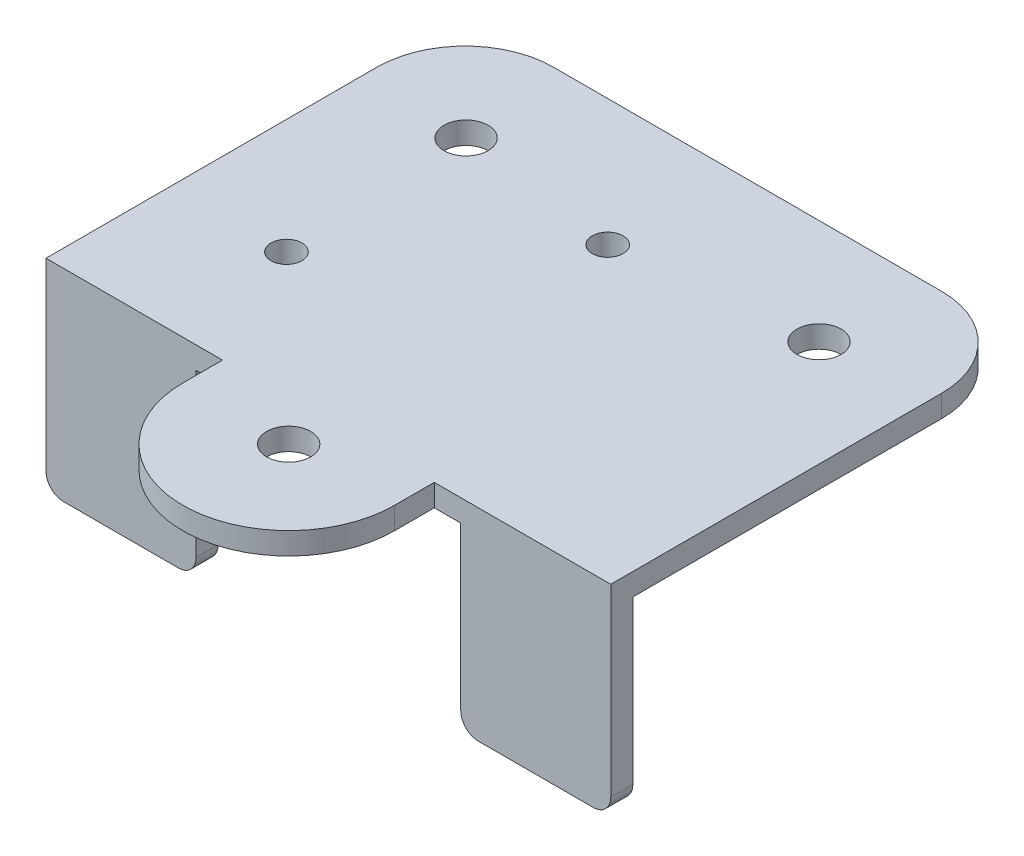
ISO-10303-21;
HEADER;
FILE_DESCRIPTION(('STEP AP214'),'2;1');
FILE_NAME('part.step','',(''),(''),'','','');
FILE_SCHEMA(('AUTOMOTIVE_DESIGN { 1 0 10303 214 1 1 1 1 }'));
ENDSEC;
DATA;
#1=APPLICATION_CONTEXT('core data for automotive mechanical design processes');
#2=APPLICATION_PROTOCOL_DEFINITION('international standard','automotive_design',2000,#1);
#3=PRODUCT_CONTEXT('',#1,'mechanical');
#4=PRODUCT('Part','Part','',(#3));
#5=PRODUCT_RELATED_PRODUCT_CATEGORY('part','',(#4));
#6=PRODUCT_DEFINITION_FORMATION('','',#4);
#7=PRODUCT_DEFINITION_CONTEXT('part definition',#1,'design');
#8=PRODUCT_DEFINITION('design','',#6,#7);
#9=PRODUCT_DEFINITION_SHAPE('','',#8);
#10=(LENGTH_UNIT() NAMED_UNIT(*) SI_UNIT(.MILLI.,.METRE.));
#11=(NAMED_UNIT(*) PLANE_ANGLE_UNIT() SI_UNIT($,.RADIAN.));
#12=(NAMED_UNIT(*) SI_UNIT($,.STERADIAN.) SOLID_ANGLE_UNIT());
#13=UNCERTAINTY_MEASURE_WITH_UNIT(LENGTH_MEASURE(1.E-05),#10,'distance_accuracy_value','');
#14=(GEOMETRIC_REPRESENTATION_CONTEXT(3) GLOBAL_UNCERTAINTY_ASSIGNED_CONTEXT((#13)) GLOBAL_UNIT_ASSIGNED_CONTEXT((#10,
#11,#12)) REPRESENTATION_CONTEXT('',''));
#15=CARTESIAN_POINT('',(0.,0.,0.));
#16=DIRECTION('',(0.,0.,1.));
#17=DIRECTION('',(1.,0.,0.));
#18=AXIS2_PLACEMENT_3D('',#15,#16,#17);
#19=CARTESIAN_POINT('',(0.,0.,0.));
#20=DIRECTION('',(0.,1.,0.));
#21=DIRECTION('',(0.,0.,1.));
#22=AXIS2_PLACEMENT_3D('',#19,#20,#21);
#23=PLANE('',#22);
#24=CARTESIAN_POINT('',(-20.,0.,-11.85));
#25=DIRECTION('',(0.,1.,0.));
#26=DIRECTION('',(0.,0.,1.));
#27=AXIS2_PLACEMENT_3D('',#24,#25,#26);
#28=CIRCLE('',#27,2.5);
#29=CARTESIAN_POINT('',(-20.,0.,-9.35));
#30=VERTEX_POINT('',#29);
#31=EDGE_CURVE('E192',#30,#30,#28,.T.);
#32=ORIENTED_EDGE('',*,*,#31,.T.);
#33=EDGE_LOOP('',(#32));
#34=FACE_BOUND('',#33,.T.);
#35=CARTESIAN_POINT('',(20.,0.,-11.85));
#36=DIRECTION('',(0.,1.,0.));
#37=DIRECTION('',(0.,0.,1.));
#38=AXIS2_PLACEMENT_3D('',#35,#36,#37);
#39=CIRCLE('',#38,2.5);
#40=CARTESIAN_POINT('',(20.,0.,-9.35));
#41=VERTEX_POINT('',#40);
#42=EDGE_CURVE('E490',#41,#41,#39,.T.);
#43=ORIENTED_EDGE('',*,*,#42,.T.);
#44=EDGE_LOOP('',(#43));
#45=FACE_BOUND('',#44,.T.);
#46=CARTESIAN_POINT('',(-1.5,0.,-9.4));
#47=DIRECTION('',(0.,1.,0.));
#48=DIRECTION('',(0.,0.,1.));
#49=AXIS2_PLACEMENT_3D('',#46,#47,#48);
#50=CIRCLE('',#49,1.75);
#51=CARTESIAN_POINT('',(-1.5,0.,-7.65));
#52=VERTEX_POINT('',#51);
#53=EDGE_CURVE('E329',#52,#52,#50,.T.);
#54=ORIENTED_EDGE('',*,*,#53,.T.);
#55=EDGE_LOOP('',(#54));
#56=FACE_BOUND('',#55,.T.);
#57=CARTESIAN_POINT('',(-19.,0.,9.5));
#58=DIRECTION('',(0.,1.,0.));
#59=DIRECTION('',(0.,0.,1.));
#60=AXIS2_PLACEMENT_3D('',#57,#58,#59);
#61=CIRCLE('',#60,1.75);
#62=CARTESIAN_POINT('',(-19.,0.,11.25));
#63=VERTEX_POINT('',#62);
#64=EDGE_CURVE('E325',#63,#63,#61,.T.);
#65=ORIENTED_EDGE('',*,*,#64,.T.);
#66=EDGE_LOOP('',(#65));
#67=FACE_BOUND('',#66,.T.);
#68=CARTESIAN_POINT('',(0.,0.,28.25));
#69=DIRECTION('',(0.,1.,0.));
#70=DIRECTION('',(0.,0.,1.));
#71=AXIS2_PLACEMENT_3D('',#68,#69,#70);
#72=CIRCLE('',#71,2.5);
#73=CARTESIAN_POINT('',(0.,0.,30.75));
#74=VERTEX_POINT('',#73);
#75=EDGE_CURVE('E299',#74,#74,#72,.F.);
#76=ORIENTED_EDGE('',*,*,#75,.F.);
#77=EDGE_LOOP('',(#76));
#78=FACE_BOUND('',#77,.T.);
#79=DIRECTION('',(0.,0.,-1.));
#80=VECTOR('',#79,1.);
#81=CARTESIAN_POINT('',(15.,0.,23.75));
#82=LINE('',#81,#80);
#83=CARTESIAN_POINT('',(15.,0.,23.75));
#84=VERTEX_POINT('',#83);
#85=CARTESIAN_POINT('',(15.,0.,21.25));
#86=VERTEX_POINT('',#85);
#87=EDGE_CURVE('E178',#84,#86,#82,.T.);
#88=ORIENTED_EDGE('',*,*,#87,.F.);
#89=DIRECTION('',(1.,0.,0.));
#90=VECTOR('',#89,1.);
#91=CARTESIAN_POINT('',(-32.,0.,23.75));
#92=LINE('',#91,#90);
#93=CARTESIAN_POINT('',(12.,0.,23.75));
#94=VERTEX_POINT('',#93);
#95=EDGE_CURVE('E187',#94,#84,#92,.T.);
#96=ORIENTED_EDGE('',*,*,#95,.F.);
#97=DIRECTION('',(0.,0.,1.));
#98=VECTOR('',#97,1.);
#99=CARTESIAN_POINT('',(12.,0.,23.75));
#100=LINE('',#99,#98);
#101=CARTESIAN_POINT('',(12.,0.,28.25));
#102=VERTEX_POINT('',#101);
#103=EDGE_CURVE('E297',#94,#102,#100,.T.);
#104=ORIENTED_EDGE('',*,*,#103,.T.);
#105=CARTESIAN_POINT('',(0.,0.,28.25));
#106=DIRECTION('',(0.,1.,0.));
#107=DIRECTION('',(0.,0.,1.));
#108=AXIS2_PLACEMENT_3D('',#105,#106,#107);
#109=CIRCLE('',#108,12.);
#110=CARTESIAN_POINT('',(-12.,0.,28.25));
#111=VERTEX_POINT('',#110);
#112=EDGE_CURVE('E300',#102,#111,#109,.F.);
#113=ORIENTED_EDGE('',*,*,#112,.T.);
#114=DIRECTION('',(0.,0.,-1.));
#115=VECTOR('',#114,1.);
#116=CARTESIAN_POINT('',(-12.,0.,28.25));
#117=LINE('',#116,#115);
#118=CARTESIAN_POINT('',(-12.,0.,23.75));
#119=VERTEX_POINT('',#118);
#120=EDGE_CURVE('E301',#111,#119,#117,.T.);
#121=ORIENTED_EDGE('',*,*,#120,.T.);
#122=CARTESIAN_POINT('',(-15.,0.,23.75));
#123=VERTEX_POINT('',#122);
#124=EDGE_CURVE('E197',#123,#119,#92,.T.);
#125=ORIENTED_EDGE('',*,*,#124,.F.);
#126=DIRECTION('',(0.,0.,1.));
#127=VECTOR('',#126,1.);
#128=CARTESIAN_POINT('',(-15.,0.,23.75));
#129=LINE('',#128,#127);
#130=CARTESIAN_POINT('',(-15.,0.,21.25));
#131=VERTEX_POINT('',#130);
#132=EDGE_CURVE('E283',#131,#123,#129,.T.);
#133=ORIENTED_EDGE('',*,*,#132,.F.);
#134=DIRECTION('',(1.,0.,0.));
#135=VECTOR('',#134,1.);
#136=CARTESIAN_POINT('',(-32.,0.,21.25));
#137=LINE('',#136,#135);
#138=CARTESIAN_POINT('',(-32.,0.,21.25));
#139=VERTEX_POINT('',#138);
#140=EDGE_CURVE('E182',#139,#131,#137,.T.);
#141=ORIENTED_EDGE('',*,*,#140,.F.);
#142=DIRECTION('',(0.,0.,1.));
#143=VECTOR('',#142,1.);
#144=CARTESIAN_POINT('',(-32.,0.,-23.75));
#145=LINE('',#144,#143);
#146=CARTESIAN_POINT('',(-32.,0.,-13.75));
#147=VERTEX_POINT('',#146);
#148=EDGE_CURVE('E198',#147,#139,#145,.T.);
#149=ORIENTED_EDGE('',*,*,#148,.F.);
#150=CARTESIAN_POINT('',(-22.,0.,-13.75));
#151=DIRECTION('',(0.,1.,0.));
#152=DIRECTION('',(0.,0.,1.));
#153=AXIS2_PLACEMENT_3D('',#150,#151,#152);
#154=CIRCLE('',#153,10.);
#155=CARTESIAN_POINT('',(-22.,0.,-23.75));
#156=VERTEX_POINT('',#155);
#157=EDGE_CURVE('E217',#147,#156,#154,.F.);
#158=ORIENTED_EDGE('',*,*,#157,.T.);
#159=DIRECTION('',(-1.,0.,0.));
#160=VECTOR('',#159,1.);
#161=CARTESIAN_POINT('',(-32.,0.,-23.75));
#162=LINE('',#161,#160);
#163=CARTESIAN_POINT('',(22.,0.,-23.75));
#164=VERTEX_POINT('',#163);
#165=EDGE_CURVE('E202',#164,#156,#162,.T.);
#166=ORIENTED_EDGE('',*,*,#165,.F.);
#167=CARTESIAN_POINT('',(22.,0.,-13.75));
#168=DIRECTION('',(0.,1.,0.));
#169=DIRECTION('',(0.,0.,1.));
#170=AXIS2_PLACEMENT_3D('',#167,#168,#169);
#171=CIRCLE('',#170,10.);
#172=CARTESIAN_POINT('',(32.,0.,-13.75));
#173=VERTEX_POINT('',#172);
#174=EDGE_CURVE('E219',#164,#173,#171,.F.);
#175=ORIENTED_EDGE('',*,*,#174,.T.);
#176=DIRECTION('',(0.,0.,-1.));
#177=VECTOR('',#176,1.);
#178=CARTESIAN_POINT('',(32.,0.,-23.75));
#179=LINE('',#178,#177);
#180=CARTESIAN_POINT('',(32.,0.,21.25));
#181=VERTEX_POINT('',#180);
#182=EDGE_CURVE('E335',#181,#173,#179,.T.);
#183=ORIENTED_EDGE('',*,*,#182,.F.);
#184=DIRECTION('',(1.,0.,0.));
#185=VECTOR('',#184,1.);
#186=CARTESIAN_POINT('',(32.,0.,21.25));
#187=LINE('',#186,#185);
#188=EDGE_CURVE('E191',#86,#181,#187,.T.);
#189=ORIENTED_EDGE('',*,*,#188,.F.);
#190=EDGE_LOOP('',(#88,#96,#104,#113,#121,#125,#133,#141,#149,#158,#166,#175,#183,#189));
#191=FACE_BOUND('',#190,.T.);
#192=ADVANCED_FACE('F39',(#34,#45,#56,#67,#78,#191),#23,.F.);
#193=CARTESIAN_POINT('',(-32.,2.5,23.75));
#194=DIRECTION('',(0.,0.,-1.));
#195=DIRECTION('',(-1.,0.,0.));
#196=AXIS2_PLACEMENT_3D('',#193,#194,#195);
#197=PLANE('',#196);
#198=DIRECTION('',(0.,1.,0.));
#199=VECTOR('',#198,1.);
#200=CARTESIAN_POINT('',(15.,-20.4,23.75));
#201=LINE('',#200,#199);
#202=CARTESIAN_POINT('',(15.,-18.4,23.75));
#203=VERTEX_POINT('',#202);
#204=EDGE_CURVE('E175',#203,#84,#201,.T.);
#205=ORIENTED_EDGE('',*,*,#204,.F.);
#206=CARTESIAN_POINT('',(17.,-18.4,23.75));
#207=DIRECTION('',(0.,0.,-1.));
#208=DIRECTION('',(-1.,0.,0.));
#209=AXIS2_PLACEMENT_3D('',#206,#207,#208);
#210=CIRCLE('',#209,2.);
#211=CARTESIAN_POINT('',(17.,-20.4,23.75));
#212=VERTEX_POINT('',#211);
#213=EDGE_CURVE('E47',#203,#212,#210,.F.);
#214=ORIENTED_EDGE('',*,*,#213,.T.);
#215=DIRECTION('',(-1.,0.,0.));
#216=VECTOR('',#215,1.);
#217=CARTESIAN_POINT('',(32.,-20.4,23.75));
#218=LINE('',#217,#216);
#219=CARTESIAN_POINT('',(30.,-20.4,23.75));
#220=VERTEX_POINT('',#219);
#221=EDGE_CURVE('E261',#220,#212,#218,.T.);
#222=ORIENTED_EDGE('',*,*,#221,.F.);
#223=CARTESIAN_POINT('',(30.,-18.4,23.75));
#224=DIRECTION('',(0.,0.,-1.));
#225=DIRECTION('',(-1.,0.,0.));
#226=AXIS2_PLACEMENT_3D('',#223,#224,#225);
#227=CIRCLE('',#226,2.);
#228=CARTESIAN_POINT('',(32.,-18.4,23.75));
#229=VERTEX_POINT('',#228);
#230=EDGE_CURVE('E54',#220,#229,#227,.F.);
#231=ORIENTED_EDGE('',*,*,#230,.T.);
#232=DIRECTION('',(0.,-1.,0.));
#233=VECTOR('',#232,1.);
#234=CARTESIAN_POINT('',(32.,2.5,23.75));
#235=LINE('',#234,#233);
#236=CARTESIAN_POINT('',(32.,2.5,23.75));
#237=VERTEX_POINT('',#236);
#238=EDGE_CURVE('E206',#237,#229,#235,.T.);
#239=ORIENTED_EDGE('',*,*,#238,.F.);
#240=DIRECTION('',(1.,0.,0.));
#241=VECTOR('',#240,1.);
#242=CARTESIAN_POINT('',(-32.,2.5,23.75));
#243=LINE('',#242,#241);
#244=CARTESIAN_POINT('',(12.,2.5,23.75));
#245=VERTEX_POINT('',#244);
#246=EDGE_CURVE('E345',#245,#237,#243,.T.);
#247=ORIENTED_EDGE('',*,*,#246,.F.);
#248=DIRECTION('',(0.,1.,0.));
#249=VECTOR('',#248,1.);
#250=CARTESIAN_POINT('',(12.,-29.1247317584214,23.75));
#251=LINE('',#250,#249);
#252=EDGE_CURVE('E196',#94,#245,#251,.T.);
#253=ORIENTED_EDGE('',*,*,#252,.F.);
#254=ORIENTED_EDGE('',*,*,#95,.T.);
#255=EDGE_LOOP('',(#205,#214,#222,#231,#239,#247,#253,#254));
#256=FACE_BOUND('',#255,.T.);
#257=ADVANCED_FACE('F194',(#256),#197,.F.);
#258=CARTESIAN_POINT('',(0.,2.5,0.));
#259=DIRECTION('',(0.,1.,0.));
#260=DIRECTION('',(0.,0.,1.));
#261=AXIS2_PLACEMENT_3D('',#258,#259,#260);
#262=PLANE('',#261);
#263=CARTESIAN_POINT('',(-20.,2.5,-11.85));
#264=DIRECTION('',(0.,1.,0.));
#265=DIRECTION('',(0.,0.,1.));
#266=AXIS2_PLACEMENT_3D('',#263,#264,#265);
#267=CIRCLE('',#266,2.5);
#268=CARTESIAN_POINT('',(-20.,2.5,-9.35));
#269=VERTEX_POINT('',#268);
#270=EDGE_CURVE('E483',#269,#269,#267,.T.);
#271=ORIENTED_EDGE('',*,*,#270,.F.);
#272=EDGE_LOOP('',(#271));
#273=FACE_BOUND('',#272,.T.);
#274=CARTESIAN_POINT('',(20.,2.5,-11.85));
#275=DIRECTION('',(0.,1.,0.));
#276=DIRECTION('',(0.,0.,1.));
#277=AXIS2_PLACEMENT_3D('',#274,#275,#276);
#278=CIRCLE('',#277,2.5);
#279=CARTESIAN_POINT('',(20.,2.5,-9.35));
#280=VERTEX_POINT('',#279);
#281=EDGE_CURVE('E487',#280,#280,#278,.T.);
#282=ORIENTED_EDGE('',*,*,#281,.F.);
#283=EDGE_LOOP('',(#282));
#284=FACE_BOUND('',#283,.T.);
#285=CARTESIAN_POINT('',(-1.5,2.5,-9.4));
#286=DIRECTION('',(0.,1.,0.));
#287=DIRECTION('',(0.,0.,1.));
#288=AXIS2_PLACEMENT_3D('',#285,#286,#287);
#289=CIRCLE('',#288,1.75);
#290=CARTESIAN_POINT('',(-1.5,2.5,-7.65));
#291=VERTEX_POINT('',#290);
#292=EDGE_CURVE('E332',#291,#291,#289,.T.);
#293=ORIENTED_EDGE('',*,*,#292,.F.);
#294=EDGE_LOOP('',(#293));
#295=FACE_BOUND('',#294,.T.);
#296=DIRECTION('',(0.,0.,-1.));
#297=VECTOR('',#296,1.);
#298=CARTESIAN_POINT('',(32.,2.5,-23.75));
#299=LINE('',#298,#297);
#300=CARTESIAN_POINT('',(32.,2.5,-13.75));
#301=VERTEX_POINT('',#300);
#302=EDGE_CURVE('E200',#237,#301,#299,.T.);
#303=ORIENTED_EDGE('',*,*,#302,.T.);
#304=CARTESIAN_POINT('',(22.,2.5,-13.75));
#305=DIRECTION('',(0.,1.,0.));
#306=DIRECTION('',(0.,0.,1.));
#307=AXIS2_PLACEMENT_3D('',#304,#305,#306);
#308=CIRCLE('',#307,10.);
#309=CARTESIAN_POINT('',(22.,2.5,-23.75));
#310=VERTEX_POINT('',#309);
#311=EDGE_CURVE('E226',#301,#310,#308,.T.);
#312=ORIENTED_EDGE('',*,*,#311,.T.);
#313=DIRECTION('',(-1.,0.,0.));
#314=VECTOR('',#313,1.);
#315=CARTESIAN_POINT('',(-32.,2.5,-23.75));
#316=LINE('',#315,#314);
#317=CARTESIAN_POINT('',(-22.,2.5,-23.75));
#318=VERTEX_POINT('',#317);
#319=EDGE_CURVE('E340',#310,#318,#316,.T.);
#320=ORIENTED_EDGE('',*,*,#319,.T.);
#321=CARTESIAN_POINT('',(-22.,2.5,-13.75));
#322=DIRECTION('',(0.,1.,0.));
#323=DIRECTION('',(0.,0.,1.));
#324=AXIS2_PLACEMENT_3D('',#321,#322,#323);
#325=CIRCLE('',#324,10.);
#326=CARTESIAN_POINT('',(-32.,2.5,-13.75));
#327=VERTEX_POINT('',#326);
#328=EDGE_CURVE('E224',#318,#327,#325,.T.);
#329=ORIENTED_EDGE('',*,*,#328,.T.);
#330=DIRECTION('',(0.,0.,1.));
#331=VECTOR('',#330,1.);
#332=CARTESIAN_POINT('',(-32.,2.5,-23.75));
#333=LINE('',#332,#331);
#334=CARTESIAN_POINT('',(-32.,2.5,23.75));
#335=VERTEX_POINT('',#334);
#336=EDGE_CURVE('E343',#327,#335,#333,.T.);
#337=ORIENTED_EDGE('',*,*,#336,.T.);
#338=CARTESIAN_POINT('',(-12.,2.5,23.75));
#339=VERTEX_POINT('',#338);
#340=EDGE_CURVE('E209',#335,#339,#243,.T.);
#341=ORIENTED_EDGE('',*,*,#340,.T.);
#342=DIRECTION('',(0.,0.,1.));
#343=VECTOR('',#342,1.);
#344=CARTESIAN_POINT('',(-12.,2.5,28.25));
#345=LINE('',#344,#343);
#346=CARTESIAN_POINT('',(-12.,2.5,28.25));
#347=VERTEX_POINT('',#346);
#348=EDGE_CURVE('E314',#339,#347,#345,.T.);
#349=ORIENTED_EDGE('',*,*,#348,.T.);
#350=CARTESIAN_POINT('',(0.,2.5,28.25));
#351=DIRECTION('',(0.,1.,0.));
#352=DIRECTION('',(0.,0.,1.));
#353=AXIS2_PLACEMENT_3D('',#350,#351,#352);
#354=CIRCLE('',#353,12.);
#355=CARTESIAN_POINT('',(12.,2.5,28.25));
#356=VERTEX_POINT('',#355);
#357=EDGE_CURVE('E308',#347,#356,#354,.T.);
#358=ORIENTED_EDGE('',*,*,#357,.T.);
#359=DIRECTION('',(0.,0.,-1.));
#360=VECTOR('',#359,1.);
#361=CARTESIAN_POINT('',(12.,2.5,23.75));
#362=LINE('',#361,#360);
#363=EDGE_CURVE('E311',#356,#245,#362,.T.);
#364=ORIENTED_EDGE('',*,*,#363,.T.);
#365=ORIENTED_EDGE('',*,*,#246,.T.);
#366=EDGE_LOOP('',(#303,#312,#320,#329,#337,#341,#349,#358,#364,#365));
#367=FACE_BOUND('',#366,.T.);
#368=CARTESIAN_POINT('',(-19.,2.5,9.5));
#369=DIRECTION('',(0.,1.,0.));
#370=DIRECTION('',(0.,0.,1.));
#371=AXIS2_PLACEMENT_3D('',#368,#369,#370);
#372=CIRCLE('',#371,1.75);
#373=CARTESIAN_POINT('',(-19.,2.5,11.25));
#374=VERTEX_POINT('',#373);
#375=EDGE_CURVE('E326',#374,#374,#372,.T.);
#376=ORIENTED_EDGE('',*,*,#375,.F.);
#377=EDGE_LOOP('',(#376));
#378=FACE_BOUND('',#377,.T.);
#379=CARTESIAN_POINT('',(0.,2.5,28.25));
#380=DIRECTION('',(0.,1.,0.));
#381=DIRECTION('',(0.,0.,1.));
#382=AXIS2_PLACEMENT_3D('',#379,#380,#381);
#383=CIRCLE('',#382,2.5);
#384=CARTESIAN_POINT('',(0.,2.5,30.75));
#385=VERTEX_POINT('',#384);
#386=EDGE_CURVE('E296',#385,#385,#383,.T.);
#387=ORIENTED_EDGE('',*,*,#386,.F.);
#388=EDGE_LOOP('',(#387));
#389=FACE_BOUND('',#388,.T.);
#390=ADVANCED_FACE('F361',(#273,#284,#295,#367,#378,#389),#262,.T.);
#391=CARTESIAN_POINT('',(32.,2.5,-23.75));
#392=DIRECTION('',(-1.,0.,0.));
#393=DIRECTION('',(0.,0.,1.));
#394=AXIS2_PLACEMENT_3D('',#391,#392,#393);
#395=PLANE('',#394);
#396=ORIENTED_EDGE('',*,*,#238,.T.);
#397=DIRECTION('',(0.,0.,1.));
#398=VECTOR('',#397,1.);
#399=CARTESIAN_POINT('',(32.,-18.4,-23.75));
#400=LINE('',#399,#398);
#401=CARTESIAN_POINT('',(32.,-18.4,21.25));
#402=VERTEX_POINT('',#401);
#403=EDGE_CURVE('E11',#229,#402,#400,.F.);
#404=ORIENTED_EDGE('',*,*,#403,.T.);
#405=DIRECTION('',(0.,1.,0.));
#406=VECTOR('',#405,1.);
#407=CARTESIAN_POINT('',(32.,-20.4,21.25));
#408=LINE('',#407,#406);
#409=EDGE_CURVE('E274',#402,#181,#408,.T.);
#410=ORIENTED_EDGE('',*,*,#409,.T.);
#411=ORIENTED_EDGE('',*,*,#182,.T.);
#412=DIRECTION('',(0.,-1.,0.));
#413=VECTOR('',#412,1.);
#414=CARTESIAN_POINT('',(32.,2.5,-13.75));
#415=LINE('',#414,#413);
#416=EDGE_CURVE('E222',#173,#301,#415,.F.);
#417=ORIENTED_EDGE('',*,*,#416,.T.);
#418=ORIENTED_EDGE('',*,*,#302,.F.);
#419=EDGE_LOOP('',(#396,#404,#410,#411,#417,#418));
#420=FACE_BOUND('',#419,.T.);
#421=ADVANCED_FACE('F435',(#420),#395,.F.);
#422=CARTESIAN_POINT('',(-32.,2.5,-23.75));
#423=DIRECTION('',(0.,0.,1.));
#424=DIRECTION('',(1.,0.,0.));
#425=AXIS2_PLACEMENT_3D('',#422,#423,#424);
#426=PLANE('',#425);
#427=ORIENTED_EDGE('',*,*,#319,.F.);
#428=DIRECTION('',(0.,-1.,0.));
#429=VECTOR('',#428,1.);
#430=CARTESIAN_POINT('',(22.,2.5,-23.75));
#431=LINE('',#430,#429);
#432=EDGE_CURVE('E214',#310,#164,#431,.T.);
#433=ORIENTED_EDGE('',*,*,#432,.T.);
#434=ORIENTED_EDGE('',*,*,#165,.T.);
#435=DIRECTION('',(0.,-1.,0.));
#436=VECTOR('',#435,1.);
#437=CARTESIAN_POINT('',(-22.,2.5,-23.75));
#438=LINE('',#437,#436);
#439=EDGE_CURVE('E212',#156,#318,#438,.F.);
#440=ORIENTED_EDGE('',*,*,#439,.T.);
#441=EDGE_LOOP('',(#427,#433,#434,#440));
#442=FACE_BOUND('',#441,.T.);
#443=ADVANCED_FACE('F353',(#442),#426,.F.);
#444=CARTESIAN_POINT('',(-32.,2.5,-23.75));
#445=DIRECTION('',(1.,0.,0.));
#446=DIRECTION('',(0.,0.,-1.));
#447=AXIS2_PLACEMENT_3D('',#444,#445,#446);
#448=PLANE('',#447);
#449=DIRECTION('',(0.,1.,0.));
#450=VECTOR('',#449,1.);
#451=CARTESIAN_POINT('',(-32.,-20.4,21.25));
#452=LINE('',#451,#450);
#453=CARTESIAN_POINT('',(-32.,-18.4,21.25));
#454=VERTEX_POINT('',#453);
#455=EDGE_CURVE('E294',#454,#139,#452,.T.);
#456=ORIENTED_EDGE('',*,*,#455,.F.);
#457=DIRECTION('',(0.,0.,-1.));
#458=VECTOR('',#457,1.);
#459=CARTESIAN_POINT('',(-32.,-18.4,23.75));
#460=LINE('',#459,#458);
#461=CARTESIAN_POINT('',(-32.,-18.4,23.75));
#462=VERTEX_POINT('',#461);
#463=EDGE_CURVE('E241',#454,#462,#460,.F.);
#464=ORIENTED_EDGE('',*,*,#463,.T.);
#465=DIRECTION('',(0.,-1.,0.));
#466=VECTOR('',#465,1.);
#467=CARTESIAN_POINT('',(-32.,2.5,23.75));
#468=LINE('',#467,#466);
#469=EDGE_CURVE('E208',#335,#462,#468,.T.);
#470=ORIENTED_EDGE('',*,*,#469,.F.);
#471=ORIENTED_EDGE('',*,*,#336,.F.);
#472=DIRECTION('',(0.,-1.,0.));
#473=VECTOR('',#472,1.);
#474=CARTESIAN_POINT('',(-32.,2.5,-13.75));
#475=LINE('',#474,#473);
#476=EDGE_CURVE('E228',#327,#147,#475,.T.);
#477=ORIENTED_EDGE('',*,*,#476,.T.);
#478=ORIENTED_EDGE('',*,*,#148,.T.);
#479=EDGE_LOOP('',(#456,#464,#470,#471,#477,#478));
#480=FACE_BOUND('',#479,.T.);
#481=ADVANCED_FACE('F366',(#480),#448,.F.);
#482=ORIENTED_EDGE('',*,*,#469,.T.);
#483=CARTESIAN_POINT('',(-30.,-18.4,23.75));
#484=DIRECTION('',(0.,0.,-1.));
#485=DIRECTION('',(-1.,0.,0.));
#486=AXIS2_PLACEMENT_3D('',#483,#484,#485);
#487=CIRCLE('',#486,2.);
#488=CARTESIAN_POINT('',(-30.,-20.4,23.75));
#489=VERTEX_POINT('',#488);
#490=EDGE_CURVE('E245',#462,#489,#487,.F.);
#491=ORIENTED_EDGE('',*,*,#490,.T.);
#492=DIRECTION('',(-1.,0.,0.));
#493=VECTOR('',#492,1.);
#494=CARTESIAN_POINT('',(-32.,-20.4,23.75));
#495=LINE('',#494,#493);
#496=CARTESIAN_POINT('',(-17.,-20.4,23.75));
#497=VERTEX_POINT('',#496);
#498=EDGE_CURVE('E282',#497,#489,#495,.T.);
#499=ORIENTED_EDGE('',*,*,#498,.F.);
#500=CARTESIAN_POINT('',(-17.,-18.4,23.75));
#501=DIRECTION('',(0.,0.,-1.));
#502=DIRECTION('',(-1.,0.,0.));
#503=AXIS2_PLACEMENT_3D('',#500,#501,#502);
#504=CIRCLE('',#503,2.);
#505=CARTESIAN_POINT('',(-15.,-18.4,23.75));
#506=VERTEX_POINT('',#505);
#507=EDGE_CURVE('E243',#497,#506,#504,.F.);
#508=ORIENTED_EDGE('',*,*,#507,.T.);
#509=DIRECTION('',(0.,1.,0.));
#510=VECTOR('',#509,1.);
#511=CARTESIAN_POINT('',(-15.,-20.4,23.75));
#512=LINE('',#511,#510);
#513=EDGE_CURVE('E286',#506,#123,#512,.T.);
#514=ORIENTED_EDGE('',*,*,#513,.T.);
#515=ORIENTED_EDGE('',*,*,#124,.T.);
#516=DIRECTION('',(0.,1.,0.));
#517=VECTOR('',#516,1.);
#518=CARTESIAN_POINT('',(-12.,-29.1247317584214,23.75));
#519=LINE('',#518,#517);
#520=EDGE_CURVE('E319',#119,#339,#519,.T.);
#521=ORIENTED_EDGE('',*,*,#520,.T.);
#522=ORIENTED_EDGE('',*,*,#340,.F.);
#523=EDGE_LOOP('',(#482,#491,#499,#508,#514,#515,#521,#522));
#524=FACE_BOUND('',#523,.T.);
#525=ADVANCED_FACE('F372',(#524),#197,.F.);
#526=CARTESIAN_POINT('',(-1.5,2.5,-9.4));
#527=DIRECTION('',(0.,-1.,0.));
#528=DIRECTION('',(0.,0.,-1.));
#529=AXIS2_PLACEMENT_3D('',#526,#527,#528);
#530=CYLINDRICAL_SURFACE('',#529,1.75);
#531=ORIENTED_EDGE('',*,*,#292,.T.);
#532=EDGE_LOOP('',(#531));
#533=FACE_BOUND('',#532,.T.);
#534=ORIENTED_EDGE('',*,*,#53,.F.);
#535=EDGE_LOOP('',(#534));
#536=FACE_BOUND('',#535,.T.);
#537=ADVANCED_FACE('F430',(#533,#536),#530,.F.);
#538=CARTESIAN_POINT('',(-19.,2.5,9.5));
#539=DIRECTION('',(0.,-1.,0.));
#540=DIRECTION('',(0.,0.,-1.));
#541=AXIS2_PLACEMENT_3D('',#538,#539,#540);
#542=CYLINDRICAL_SURFACE('',#541,1.75);
#543=ORIENTED_EDGE('',*,*,#375,.T.);
#544=EDGE_LOOP('',(#543));
#545=FACE_BOUND('',#544,.T.);
#546=ORIENTED_EDGE('',*,*,#64,.F.);
#547=EDGE_LOOP('',(#546));
#548=FACE_BOUND('',#547,.T.);
#549=ADVANCED_FACE('F441',(#545,#548),#542,.F.);
#550=CARTESIAN_POINT('',(22.,2.5,-13.75));
#551=DIRECTION('',(0.,-1.,0.));
#552=DIRECTION('',(0.,0.,-1.));
#553=AXIS2_PLACEMENT_3D('',#550,#551,#552);
#554=CYLINDRICAL_SURFACE('',#553,10.);
#555=ORIENTED_EDGE('',*,*,#311,.F.);
#556=ORIENTED_EDGE('',*,*,#416,.F.);
#557=ORIENTED_EDGE('',*,*,#174,.F.);
#558=ORIENTED_EDGE('',*,*,#432,.F.);
#559=EDGE_LOOP('',(#555,#556,#557,#558));
#560=FACE_BOUND('',#559,.T.);
#561=ADVANCED_FACE('F439',(#560),#554,.T.);
#562=CARTESIAN_POINT('',(-22.,2.5,-13.75));
#563=DIRECTION('',(0.,-1.,0.));
#564=DIRECTION('',(0.,0.,-1.));
#565=AXIS2_PLACEMENT_3D('',#562,#563,#564);
#566=CYLINDRICAL_SURFACE('',#565,10.);
#567=ORIENTED_EDGE('',*,*,#328,.F.);
#568=ORIENTED_EDGE('',*,*,#439,.F.);
#569=ORIENTED_EDGE('',*,*,#157,.F.);
#570=ORIENTED_EDGE('',*,*,#476,.F.);
#571=EDGE_LOOP('',(#567,#568,#569,#570));
#572=FACE_BOUND('',#571,.T.);
#573=ADVANCED_FACE('F357',(#572),#566,.T.);
#574=CARTESIAN_POINT('',(12.,-29.1247317584214,23.75));
#575=DIRECTION('',(1.,0.,0.));
#576=DIRECTION('',(0.,0.,-1.));
#577=AXIS2_PLACEMENT_3D('',#574,#575,#576);
#578=PLANE('',#577);
#579=ORIENTED_EDGE('',*,*,#103,.F.);
#580=ORIENTED_EDGE('',*,*,#252,.T.);
#581=ORIENTED_EDGE('',*,*,#363,.F.);
#582=DIRECTION('',(0.,1.,0.));
#583=VECTOR('',#582,1.);
#584=CARTESIAN_POINT('',(12.,-29.1247317584214,28.25));
#585=LINE('',#584,#583);
#586=EDGE_CURVE('E317',#102,#356,#585,.T.);
#587=ORIENTED_EDGE('',*,*,#586,.F.);
#588=EDGE_LOOP('',(#579,#580,#581,#587));
#589=FACE_BOUND('',#588,.T.);
#590=ADVANCED_FACE('F386',(#589),#578,.T.);
#591=CARTESIAN_POINT('',(-12.,-29.1247317584214,28.25));
#592=DIRECTION('',(-1.,0.,0.));
#593=DIRECTION('',(0.,0.,1.));
#594=AXIS2_PLACEMENT_3D('',#591,#592,#593);
#595=PLANE('',#594);
#596=ORIENTED_EDGE('',*,*,#120,.F.);
#597=DIRECTION('',(0.,1.,0.));
#598=VECTOR('',#597,1.);
#599=CARTESIAN_POINT('',(-12.,-29.1247317584214,28.25));
#600=LINE('',#599,#598);
#601=EDGE_CURVE('E304',#111,#347,#600,.T.);
#602=ORIENTED_EDGE('',*,*,#601,.T.);
#603=ORIENTED_EDGE('',*,*,#348,.F.);
#604=ORIENTED_EDGE('',*,*,#520,.F.);
#605=EDGE_LOOP('',(#596,#602,#603,#604));
#606=FACE_BOUND('',#605,.T.);
#607=ADVANCED_FACE('F377',(#606),#595,.T.);
#608=CARTESIAN_POINT('',(0.,-29.1247317584214,28.25));
#609=DIRECTION('',(0.,1.,0.));
#610=DIRECTION('',(0.,0.,1.));
#611=AXIS2_PLACEMENT_3D('',#608,#609,#610);
#612=CYLINDRICAL_SURFACE('',#611,12.);
#613=ORIENTED_EDGE('',*,*,#112,.F.);
#614=ORIENTED_EDGE('',*,*,#586,.T.);
#615=ORIENTED_EDGE('',*,*,#357,.F.);
#616=ORIENTED_EDGE('',*,*,#601,.F.);
#617=EDGE_LOOP('',(#613,#614,#615,#616));
#618=FACE_BOUND('',#617,.T.);
#619=ADVANCED_FACE('F382',(#618),#612,.T.);
#620=CARTESIAN_POINT('',(0.,-29.1247317584214,28.25));
#621=DIRECTION('',(0.,1.,0.));
#622=DIRECTION('',(0.,0.,1.));
#623=AXIS2_PLACEMENT_3D('',#620,#621,#622);
#624=CYLINDRICAL_SURFACE('',#623,2.5);
#625=ORIENTED_EDGE('',*,*,#75,.T.);
#626=EDGE_LOOP('',(#625));
#627=FACE_BOUND('',#626,.T.);
#628=ORIENTED_EDGE('',*,*,#386,.T.);
#629=EDGE_LOOP('',(#628));
#630=FACE_BOUND('',#629,.T.);
#631=ADVANCED_FACE('F456',(#627,#630),#624,.F.);
#632=CARTESIAN_POINT('',(-32.,-20.4,21.25));
#633=DIRECTION('',(0.,0.,1.));
#634=DIRECTION('',(1.,0.,0.));
#635=AXIS2_PLACEMENT_3D('',#632,#633,#634);
#636=PLANE('',#635);
#637=DIRECTION('',(1.,0.,0.));
#638=VECTOR('',#637,1.);
#639=CARTESIAN_POINT('',(-32.,-20.4,21.25));
#640=LINE('',#639,#638);
#641=CARTESIAN_POINT('',(-30.,-20.4,21.25));
#642=VERTEX_POINT('',#641);
#643=CARTESIAN_POINT('',(-17.,-20.4,21.25));
#644=VERTEX_POINT('',#643);
#645=EDGE_CURVE('E279',#642,#644,#640,.T.);
#646=ORIENTED_EDGE('',*,*,#645,.F.);
#647=CARTESIAN_POINT('',(-30.,-18.4,21.25));
#648=DIRECTION('',(0.,0.,1.));
#649=DIRECTION('',(1.,0.,0.));
#650=AXIS2_PLACEMENT_3D('',#647,#648,#649);
#651=CIRCLE('',#650,2.);
#652=EDGE_CURVE('E239',#642,#454,#651,.F.);
#653=ORIENTED_EDGE('',*,*,#652,.T.);
#654=ORIENTED_EDGE('',*,*,#455,.T.);
#655=ORIENTED_EDGE('',*,*,#140,.T.);
#656=DIRECTION('',(0.,1.,0.));
#657=VECTOR('',#656,1.);
#658=CARTESIAN_POINT('',(-15.,-20.4,21.25));
#659=LINE('',#658,#657);
#660=CARTESIAN_POINT('',(-15.,-18.4,21.25));
#661=VERTEX_POINT('',#660);
#662=EDGE_CURVE('E292',#661,#131,#659,.T.);
#663=ORIENTED_EDGE('',*,*,#662,.F.);
#664=CARTESIAN_POINT('',(-17.,-18.4,21.25));
#665=DIRECTION('',(0.,0.,1.));
#666=DIRECTION('',(1.,0.,0.));
#667=AXIS2_PLACEMENT_3D('',#664,#665,#666);
#668=CIRCLE('',#667,2.);
#669=EDGE_CURVE('E237',#661,#644,#668,.F.);
#670=ORIENTED_EDGE('',*,*,#669,.T.);
#671=EDGE_LOOP('',(#646,#653,#654,#655,#663,#670));
#672=FACE_BOUND('',#671,.T.);
#673=ADVANCED_FACE('F398',(#672),#636,.F.);
#674=CARTESIAN_POINT('',(-15.,-20.4,23.75));
#675=DIRECTION('',(-1.,0.,0.));
#676=DIRECTION('',(0.,0.,1.));
#677=AXIS2_PLACEMENT_3D('',#674,#675,#676);
#678=PLANE('',#677);
#679=ORIENTED_EDGE('',*,*,#513,.F.);
#680=DIRECTION('',(0.,0.,1.));
#681=VECTOR('',#680,1.);
#682=CARTESIAN_POINT('',(-15.,-18.4,21.25));
#683=LINE('',#682,#681);
#684=EDGE_CURVE('E247',#506,#661,#683,.F.);
#685=ORIENTED_EDGE('',*,*,#684,.T.);
#686=ORIENTED_EDGE('',*,*,#662,.T.);
#687=ORIENTED_EDGE('',*,*,#132,.T.);
#688=EDGE_LOOP('',(#679,#685,#686,#687));
#689=FACE_BOUND('',#688,.T.);
#690=ADVANCED_FACE('F392',(#689),#678,.F.);
#691=CARTESIAN_POINT('',(0.,-20.4,0.));
#692=DIRECTION('',(0.,-1.,0.));
#693=DIRECTION('',(0.,0.,-1.));
#694=AXIS2_PLACEMENT_3D('',#691,#692,#693);
#695=PLANE('',#694);
#696=ORIENTED_EDGE('',*,*,#498,.T.);
#697=DIRECTION('',(0.,0.,-1.));
#698=VECTOR('',#697,1.);
#699=CARTESIAN_POINT('',(-30.,-20.4,21.25));
#700=LINE('',#699,#698);
#701=EDGE_CURVE('E234',#489,#642,#700,.T.);
#702=ORIENTED_EDGE('',*,*,#701,.T.);
#703=ORIENTED_EDGE('',*,*,#645,.T.);
#704=DIRECTION('',(0.,0.,1.));
#705=VECTOR('',#704,1.);
#706=CARTESIAN_POINT('',(-17.,-20.4,23.75));
#707=LINE('',#706,#705);
#708=EDGE_CURVE('E231',#644,#497,#707,.T.);
#709=ORIENTED_EDGE('',*,*,#708,.T.);
#710=EDGE_LOOP('',(#696,#702,#703,#709));
#711=FACE_BOUND('',#710,.T.);
#712=ADVANCED_FACE('F404',(#711),#695,.T.);
#713=CARTESIAN_POINT('',(15.,-20.4,23.75));
#714=DIRECTION('',(1.,0.,0.));
#715=DIRECTION('',(0.,0.,-1.));
#716=AXIS2_PLACEMENT_3D('',#713,#714,#715);
#717=PLANE('',#716);
#718=DIRECTION('',(0.,1.,0.));
#719=VECTOR('',#718,1.);
#720=CARTESIAN_POINT('',(15.,-20.4,21.25));
#721=LINE('',#720,#719);
#722=CARTESIAN_POINT('',(15.,-18.4,21.25));
#723=VERTEX_POINT('',#722);
#724=EDGE_CURVE('E183',#723,#86,#721,.T.);
#725=ORIENTED_EDGE('',*,*,#724,.F.);
#726=DIRECTION('',(0.,0.,-1.));
#727=VECTOR('',#726,1.);
#728=CARTESIAN_POINT('',(15.,-18.4,23.75));
#729=LINE('',#728,#727);
#730=EDGE_CURVE('E62',#723,#203,#729,.F.);
#731=ORIENTED_EDGE('',*,*,#730,.T.);
#732=ORIENTED_EDGE('',*,*,#204,.T.);
#733=ORIENTED_EDGE('',*,*,#87,.T.);
#734=EDGE_LOOP('',(#725,#731,#732,#733));
#735=FACE_BOUND('',#734,.T.);
#736=ADVANCED_FACE('F177',(#735),#717,.F.);
#737=CARTESIAN_POINT('',(32.,-20.4,21.25));
#738=DIRECTION('',(0.,0.,1.));
#739=DIRECTION('',(1.,0.,0.));
#740=AXIS2_PLACEMENT_3D('',#737,#738,#739);
#741=PLANE('',#740);
#742=DIRECTION('',(1.,0.,0.));
#743=VECTOR('',#742,1.);
#744=CARTESIAN_POINT('',(32.,-20.4,21.25));
#745=LINE('',#744,#743);
#746=CARTESIAN_POINT('',(17.,-20.4,21.25));
#747=VERTEX_POINT('',#746);
#748=CARTESIAN_POINT('',(30.,-20.4,21.25));
#749=VERTEX_POINT('',#748);
#750=EDGE_CURVE('E269',#747,#749,#745,.T.);
#751=ORIENTED_EDGE('',*,*,#750,.F.);
#752=CARTESIAN_POINT('',(17.,-18.4,21.25));
#753=DIRECTION('',(0.,0.,1.));
#754=DIRECTION('',(1.,0.,0.));
#755=AXIS2_PLACEMENT_3D('',#752,#753,#754);
#756=CIRCLE('',#755,2.);
#757=EDGE_CURVE('E257',#747,#723,#756,.F.);
#758=ORIENTED_EDGE('',*,*,#757,.T.);
#759=ORIENTED_EDGE('',*,*,#724,.T.);
#760=ORIENTED_EDGE('',*,*,#188,.T.);
#761=ORIENTED_EDGE('',*,*,#409,.F.);
#762=CARTESIAN_POINT('',(30.,-18.4,21.25));
#763=DIRECTION('',(0.,0.,1.));
#764=DIRECTION('',(1.,0.,0.));
#765=AXIS2_PLACEMENT_3D('',#762,#763,#764);
#766=CIRCLE('',#765,2.);
#767=EDGE_CURVE('E255',#402,#749,#766,.F.);
#768=ORIENTED_EDGE('',*,*,#767,.T.);
#769=EDGE_LOOP('',(#751,#758,#759,#760,#761,#768));
#770=FACE_BOUND('',#769,.T.);
#771=ADVANCED_FACE('F273',(#770),#741,.F.);
#772=CARTESIAN_POINT('',(0.,-20.4,0.));
#773=DIRECTION('',(0.,1.,0.));
#774=DIRECTION('',(0.,0.,1.));
#775=AXIS2_PLACEMENT_3D('',#772,#773,#774);
#776=PLANE('',#775);
#777=ORIENTED_EDGE('',*,*,#221,.T.);
#778=DIRECTION('',(0.,0.,-1.));
#779=VECTOR('',#778,1.);
#780=CARTESIAN_POINT('',(17.,-20.4,0.));
#781=LINE('',#780,#779);
#782=EDGE_CURVE('E252',#212,#747,#781,.T.);
#783=ORIENTED_EDGE('',*,*,#782,.T.);
#784=ORIENTED_EDGE('',*,*,#750,.T.);
#785=DIRECTION('',(0.,0.,1.));
#786=VECTOR('',#785,1.);
#787=CARTESIAN_POINT('',(30.,-20.4,0.));
#788=LINE('',#787,#786);
#789=EDGE_CURVE('E249',#749,#220,#788,.T.);
#790=ORIENTED_EDGE('',*,*,#789,.T.);
#791=EDGE_LOOP('',(#777,#783,#784,#790));
#792=FACE_BOUND('',#791,.T.);
#793=ADVANCED_FACE('F265',(#792),#776,.F.);
#794=CARTESIAN_POINT('',(-30.,-18.4,0.));
#795=DIRECTION('',(0.,0.,1.));
#796=DIRECTION('',(1.,0.,0.));
#797=AXIS2_PLACEMENT_3D('',#794,#795,#796);
#798=CYLINDRICAL_SURFACE('',#797,2.);
#799=ORIENTED_EDGE('',*,*,#490,.F.);
#800=ORIENTED_EDGE('',*,*,#463,.F.);
#801=ORIENTED_EDGE('',*,*,#652,.F.);
#802=ORIENTED_EDGE('',*,*,#701,.F.);
#803=EDGE_LOOP('',(#799,#800,#801,#802));
#804=FACE_BOUND('',#803,.T.);
#805=ADVANCED_FACE('F407',(#804),#798,.T.);
#806=CARTESIAN_POINT('',(-17.,-18.4,0.));
#807=DIRECTION('',(0.,0.,-1.));
#808=DIRECTION('',(-1.,0.,0.));
#809=AXIS2_PLACEMENT_3D('',#806,#807,#808);
#810=CYLINDRICAL_SURFACE('',#809,2.);
#811=ORIENTED_EDGE('',*,*,#669,.F.);
#812=ORIENTED_EDGE('',*,*,#684,.F.);
#813=ORIENTED_EDGE('',*,*,#507,.F.);
#814=ORIENTED_EDGE('',*,*,#708,.F.);
#815=EDGE_LOOP('',(#811,#812,#813,#814));
#816=FACE_BOUND('',#815,.T.);
#817=ADVANCED_FACE('F401',(#816),#810,.T.);
#818=CARTESIAN_POINT('',(17.,-18.4,0.));
#819=DIRECTION('',(0.,0.,-1.));
#820=DIRECTION('',(-1.,0.,0.));
#821=AXIS2_PLACEMENT_3D('',#818,#819,#820);
#822=CYLINDRICAL_SURFACE('',#821,2.);
#823=ORIENTED_EDGE('',*,*,#213,.F.);
#824=ORIENTED_EDGE('',*,*,#730,.F.);
#825=ORIENTED_EDGE('',*,*,#757,.F.);
#826=ORIENTED_EDGE('',*,*,#782,.F.);
#827=EDGE_LOOP('',(#823,#824,#825,#826));
#828=FACE_BOUND('',#827,.T.);
#829=ADVANCED_FACE('F271',(#828),#822,.T.);
#830=CARTESIAN_POINT('',(30.,-18.4,0.));
#831=DIRECTION('',(0.,0.,1.));
#832=DIRECTION('',(1.,0.,0.));
#833=AXIS2_PLACEMENT_3D('',#830,#831,#832);
#834=CYLINDRICAL_SURFACE('',#833,2.);
#835=ORIENTED_EDGE('',*,*,#767,.F.);
#836=ORIENTED_EDGE('',*,*,#403,.F.);
#837=ORIENTED_EDGE('',*,*,#230,.F.);
#838=ORIENTED_EDGE('',*,*,#789,.F.);
#839=EDGE_LOOP('',(#835,#836,#837,#838));
#840=FACE_BOUND('',#839,.T.);
#841=ADVANCED_FACE('F41',(#840),#834,.T.);
#842=CARTESIAN_POINT('',(20.,-20.4,-11.85));
#843=DIRECTION('',(0.,1.,0.));
#844=DIRECTION('',(0.,0.,1.));
#845=AXIS2_PLACEMENT_3D('',#842,#843,#844);
#846=CYLINDRICAL_SURFACE('',#845,2.5);
#847=ORIENTED_EDGE('',*,*,#281,.T.);
#848=EDGE_LOOP('',(#847));
#849=FACE_BOUND('',#848,.T.);
#850=ORIENTED_EDGE('',*,*,#42,.F.);
#851=EDGE_LOOP('',(#850));
#852=FACE_BOUND('',#851,.T.);
#853=ADVANCED_FACE('F503',(#849,#852),#846,.F.);
#854=CARTESIAN_POINT('',(-20.,-20.4,-11.85));
#855=DIRECTION('',(0.,1.,0.));
#856=DIRECTION('',(0.,0.,1.));
#857=AXIS2_PLACEMENT_3D('',#854,#855,#856);
#858=CYLINDRICAL_SURFACE('',#857,2.5);
#859=ORIENTED_EDGE('',*,*,#270,.T.);
#860=EDGE_LOOP('',(#859));
#861=FACE_BOUND('',#860,.T.);
#862=ORIENTED_EDGE('',*,*,#31,.F.);
#863=EDGE_LOOP('',(#862));
#864=FACE_BOUND('',#863,.T.);
#865=ADVANCED_FACE('F508',(#861,#864),#858,.F.);
#866=CLOSED_SHELL('',(#192,#257,#390,#421,#443,#481,#525,#537,#549,#561,#573,#590,#607,#619,
#631,#673,#690,#712,#736,#771,#793,#805,#817,#829,#841,#853,#865));
#867=MANIFOLD_SOLID_BREP('B2',#866);
#868=ADVANCED_BREP_SHAPE_REPRESENTATION('',(#18,#867),#14);
#869=SHAPE_DEFINITION_REPRESENTATION(#9,#868);
ENDSEC;
END-ISO-10303-21;
